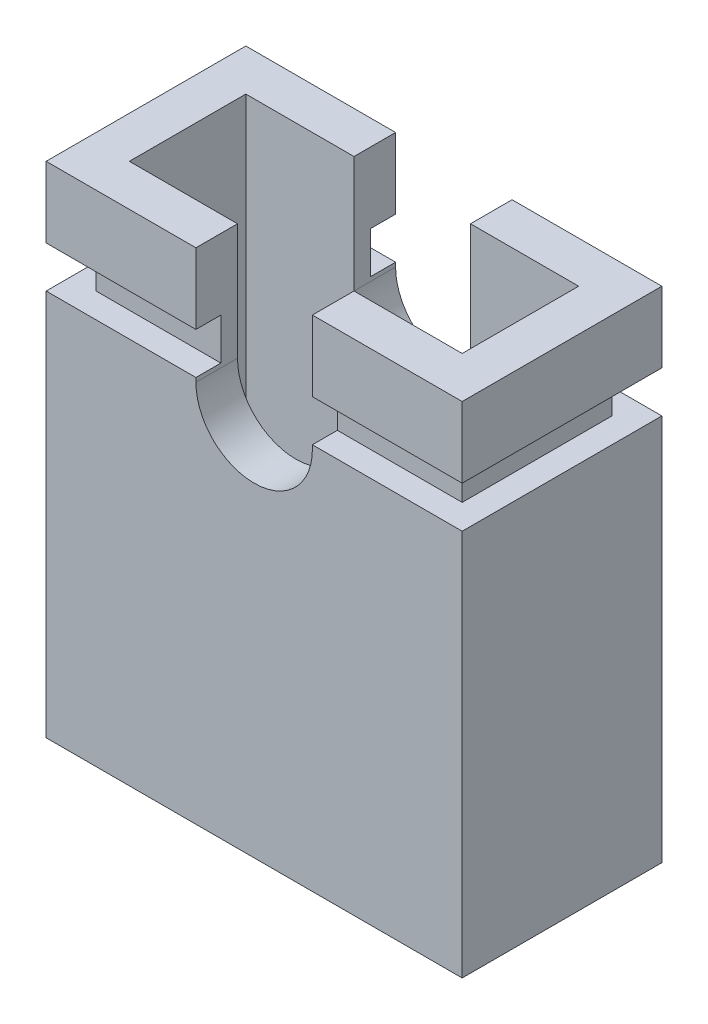
ISO-10303-21;
HEADER;
FILE_DESCRIPTION(('STEP AP214'),'2;1');
FILE_NAME('part.step','',(''),(''),'','','');
FILE_SCHEMA(('AUTOMOTIVE_DESIGN { 1 0 10303 214 1 1 1 1 }'));
ENDSEC;
DATA;
#1=APPLICATION_CONTEXT('core data for automotive mechanical design processes');
#2=APPLICATION_PROTOCOL_DEFINITION('international standard','automotive_design',2000,#1);
#3=PRODUCT_CONTEXT('',#1,'mechanical');
#4=PRODUCT('Part','Part','',(#3));
#5=PRODUCT_RELATED_PRODUCT_CATEGORY('part','',(#4));
#6=PRODUCT_DEFINITION_FORMATION('','',#4);
#7=PRODUCT_DEFINITION_CONTEXT('part definition',#1,'design');
#8=PRODUCT_DEFINITION('design','',#6,#7);
#9=PRODUCT_DEFINITION_SHAPE('','',#8);
#10=(LENGTH_UNIT() NAMED_UNIT(*) SI_UNIT(.MILLI.,.METRE.));
#11=(NAMED_UNIT(*) PLANE_ANGLE_UNIT() SI_UNIT($,.RADIAN.));
#12=(NAMED_UNIT(*) SI_UNIT($,.STERADIAN.) SOLID_ANGLE_UNIT());
#13=UNCERTAINTY_MEASURE_WITH_UNIT(LENGTH_MEASURE(1.E-05),#10,'distance_accuracy_value','');
#14=(GEOMETRIC_REPRESENTATION_CONTEXT(3) GLOBAL_UNCERTAINTY_ASSIGNED_CONTEXT((#13)) GLOBAL_UNIT_ASSIGNED_CONTEXT((#10,
#11,#12)) REPRESENTATION_CONTEXT('',''));
#15=CARTESIAN_POINT('',(0.,0.,0.));
#16=DIRECTION('',(0.,0.,1.));
#17=DIRECTION('',(1.,0.,0.));
#18=AXIS2_PLACEMENT_3D('',#15,#16,#17);
#19=CARTESIAN_POINT('',(2.6,3.,-2.448));
#20=DIRECTION('',(0.,1.,0.));
#21=DIRECTION('',(-1.,0.,0.));
#22=AXIS2_PLACEMENT_3D('',#19,#20,#21);
#23=PLANE('',#22);
#24=DIRECTION('',(0.,0.,-1.));
#25=VECTOR('',#24,1.);
#26=CARTESIAN_POINT('',(-2.,3.,-1.2));
#27=LINE('',#26,#25);
#28=CARTESIAN_POINT('',(-2.,3.,-0.5));
#29=VERTEX_POINT('',#28);
#30=CARTESIAN_POINT('',(-2.,3.,-1.9));
#31=VERTEX_POINT('',#30);
#32=EDGE_CURVE('E352',#29,#31,#27,.T.);
#33=ORIENTED_EDGE('',*,*,#32,.T.);
#34=DIRECTION('',(1.,0.,0.));
#35=VECTOR('',#34,1.);
#36=CARTESIAN_POINT('',(0.,3.,-1.9));
#37=LINE('',#36,#35);
#38=CARTESIAN_POINT('',(-0.700000000000001,3.,-1.9));
#39=VERTEX_POINT('',#38);
#40=EDGE_CURVE('E348',#31,#39,#37,.T.);
#41=ORIENTED_EDGE('',*,*,#40,.T.);
#42=DIRECTION('',(0.,0.,-1.));
#43=VECTOR('',#42,1.);
#44=CARTESIAN_POINT('',(-0.700000000000001,3.,-1.2));
#45=LINE('',#44,#43);
#46=CARTESIAN_POINT('',(-0.700000000000001,3.,-2.4));
#47=VERTEX_POINT('',#46);
#48=EDGE_CURVE('E342',#39,#47,#45,.T.);
#49=ORIENTED_EDGE('',*,*,#48,.T.);
#50=DIRECTION('',(-1.,0.,0.));
#51=VECTOR('',#50,1.);
#52=CARTESIAN_POINT('',(0.,3.,-2.4));
#53=LINE('',#52,#51);
#54=CARTESIAN_POINT('',(-2.5,3.,-2.4));
#55=VERTEX_POINT('',#54);
#56=EDGE_CURVE('E341',#47,#55,#53,.T.);
#57=ORIENTED_EDGE('',*,*,#56,.T.);
#58=DIRECTION('',(0.,0.,-1.));
#59=VECTOR('',#58,1.);
#60=CARTESIAN_POINT('',(-2.5,3.,-1.2));
#61=LINE('',#60,#59);
#62=CARTESIAN_POINT('',(-2.5,3.,0.));
#63=VERTEX_POINT('',#62);
#64=EDGE_CURVE('E338',#63,#55,#61,.T.);
#65=ORIENTED_EDGE('',*,*,#64,.F.);
#66=DIRECTION('',(-1.,0.,0.));
#67=VECTOR('',#66,1.);
#68=CARTESIAN_POINT('',(0.,3.,0.));
#69=LINE('',#68,#67);
#70=CARTESIAN_POINT('',(-0.700000000000001,3.,0.));
#71=VERTEX_POINT('',#70);
#72=EDGE_CURVE('E333',#71,#63,#69,.T.);
#73=ORIENTED_EDGE('',*,*,#72,.F.);
#74=DIRECTION('',(0.,0.,-1.));
#75=VECTOR('',#74,1.);
#76=CARTESIAN_POINT('',(-0.700000000000001,3.,-1.2));
#77=LINE('',#76,#75);
#78=CARTESIAN_POINT('',(-0.700000000000001,3.,-0.5));
#79=VERTEX_POINT('',#78);
#80=EDGE_CURVE('E345',#71,#79,#77,.T.);
#81=ORIENTED_EDGE('',*,*,#80,.T.);
#82=DIRECTION('',(-1.,0.,0.));
#83=VECTOR('',#82,1.);
#84=CARTESIAN_POINT('',(0.,3.,-0.5));
#85=LINE('',#84,#83);
#86=EDGE_CURVE('E361',#79,#29,#85,.T.);
#87=ORIENTED_EDGE('',*,*,#86,.T.);
#88=EDGE_LOOP('',(#33,#41,#49,#57,#65,#73,#81,#87));
#89=FACE_BOUND('',#88,.T.);
#90=ADVANCED_FACE('F17',(#89),#23,.T.);
#91=CARTESIAN_POINT('',(-2.6,-3.12,-2.4));
#92=DIRECTION('',(0.,0.,1.));
#93=DIRECTION('',(1.,0.,0.));
#94=AXIS2_PLACEMENT_3D('',#91,#92,#93);
#95=PLANE('',#94);
#96=DIRECTION('',(0.,-1.,0.));
#97=VECTOR('',#96,1.);
#98=CARTESIAN_POINT('',(-2.5,0.,-2.4));
#99=LINE('',#98,#97);
#100=CARTESIAN_POINT('',(-2.5,2.15,-2.4));
#101=VERTEX_POINT('',#100);
#102=EDGE_CURVE('E334',#55,#101,#99,.T.);
#103=ORIENTED_EDGE('',*,*,#102,.F.);
#104=ORIENTED_EDGE('',*,*,#56,.F.);
#105=DIRECTION('',(0.,1.,0.));
#106=VECTOR('',#105,1.);
#107=CARTESIAN_POINT('',(-0.7,0.,-2.4));
#108=LINE('',#107,#106);
#109=CARTESIAN_POINT('',(-0.7,2.15,-2.4));
#110=VERTEX_POINT('',#109);
#111=EDGE_CURVE('E351',#110,#47,#108,.T.);
#112=ORIENTED_EDGE('',*,*,#111,.F.);
#113=DIRECTION('',(-1.,0.,0.));
#114=VECTOR('',#113,1.);
#115=CARTESIAN_POINT('',(0.,2.15,-2.4));
#116=LINE('',#115,#114);
#117=EDGE_CURVE('E288',#110,#101,#116,.T.);
#118=ORIENTED_EDGE('',*,*,#117,.T.);
#119=EDGE_LOOP('',(#103,#104,#112,#118));
#120=FACE_BOUND('',#119,.T.);
#121=ADVANCED_FACE('F653',(#120),#95,.F.);
#122=CARTESIAN_POINT('',(-2.5,3.12,-2.448));
#123=DIRECTION('',(-1.,0.,0.));
#124=DIRECTION('',(0.,-1.,0.));
#125=AXIS2_PLACEMENT_3D('',#122,#123,#124);
#126=PLANE('',#125);
#127=ORIENTED_EDGE('',*,*,#64,.T.);
#128=ORIENTED_EDGE('',*,*,#102,.T.);
#129=DIRECTION('',(0.,0.,1.));
#130=VECTOR('',#129,1.);
#131=CARTESIAN_POINT('',(-2.5,2.15,-1.2));
#132=LINE('',#131,#130);
#133=CARTESIAN_POINT('',(-2.5,2.15,0.));
#134=VERTEX_POINT('',#133);
#135=EDGE_CURVE('E286',#101,#134,#132,.T.);
#136=ORIENTED_EDGE('',*,*,#135,.T.);
#137=DIRECTION('',(0.,-1.,0.));
#138=VECTOR('',#137,1.);
#139=CARTESIAN_POINT('',(-2.5,0.,0.));
#140=LINE('',#139,#138);
#141=EDGE_CURVE('E290',#63,#134,#140,.T.);
#142=ORIENTED_EDGE('',*,*,#141,.F.);
#143=EDGE_LOOP('',(#127,#128,#136,#142));
#144=FACE_BOUND('',#143,.T.);
#145=ADVANCED_FACE('F649',(#144),#126,.T.);
#146=CARTESIAN_POINT('',(-2.6,-3.12,0.));
#147=DIRECTION('',(0.,0.,1.));
#148=DIRECTION('',(1.,0.,0.));
#149=AXIS2_PLACEMENT_3D('',#146,#147,#148);
#150=PLANE('',#149);
#151=ORIENTED_EDGE('',*,*,#141,.T.);
#152=DIRECTION('',(1.,0.,0.));
#153=VECTOR('',#152,1.);
#154=CARTESIAN_POINT('',(0.,2.15,0.));
#155=LINE('',#154,#153);
#156=CARTESIAN_POINT('',(-0.7,2.15,0.));
#157=VERTEX_POINT('',#156);
#158=EDGE_CURVE('E283',#134,#157,#155,.T.);
#159=ORIENTED_EDGE('',*,*,#158,.T.);
#160=DIRECTION('',(0.,1.,0.));
#161=VECTOR('',#160,1.);
#162=CARTESIAN_POINT('',(-0.7,0.,0.));
#163=LINE('',#162,#161);
#164=EDGE_CURVE('E337',#157,#71,#163,.T.);
#165=ORIENTED_EDGE('',*,*,#164,.T.);
#166=ORIENTED_EDGE('',*,*,#72,.T.);
#167=EDGE_LOOP('',(#151,#159,#165,#166));
#168=FACE_BOUND('',#167,.T.);
#169=ADVANCED_FACE('F646',(#168),#150,.T.);
#170=CARTESIAN_POINT('',(2.6,2.15,-2.448));
#171=DIRECTION('',(0.,1.,0.));
#172=DIRECTION('',(-1.,0.,0.));
#173=AXIS2_PLACEMENT_3D('',#170,#171,#172);
#174=PLANE('',#173);
#175=DIRECTION('',(0.,0.,-1.));
#176=VECTOR('',#175,1.);
#177=CARTESIAN_POINT('',(-2.2,2.15,-1.2));
#178=LINE('',#177,#176);
#179=CARTESIAN_POINT('',(-2.2,2.15,-0.3));
#180=VERTEX_POINT('',#179);
#181=CARTESIAN_POINT('',(-2.2,2.15,-2.1));
#182=VERTEX_POINT('',#181);
#183=EDGE_CURVE('E450',#180,#182,#178,.T.);
#184=ORIENTED_EDGE('',*,*,#183,.F.);
#185=DIRECTION('',(-1.,0.,0.));
#186=VECTOR('',#185,1.);
#187=CARTESIAN_POINT('',(0.,2.15,-0.3));
#188=LINE('',#187,#186);
#189=CARTESIAN_POINT('',(-0.700000000000001,2.15,-0.3));
#190=VERTEX_POINT('',#189);
#191=EDGE_CURVE('E270',#190,#180,#188,.T.);
#192=ORIENTED_EDGE('',*,*,#191,.F.);
#193=DIRECTION('',(0.,0.,1.));
#194=VECTOR('',#193,1.);
#195=CARTESIAN_POINT('',(-0.7,2.15,-1.2));
#196=LINE('',#195,#194);
#197=EDGE_CURVE('E262',#190,#157,#196,.T.);
#198=ORIENTED_EDGE('',*,*,#197,.T.);
#199=ORIENTED_EDGE('',*,*,#158,.F.);
#200=ORIENTED_EDGE('',*,*,#135,.F.);
#201=ORIENTED_EDGE('',*,*,#117,.F.);
#202=DIRECTION('',(0.,0.,1.));
#203=VECTOR('',#202,1.);
#204=CARTESIAN_POINT('',(-0.7,2.15,-1.2));
#205=LINE('',#204,#203);
#206=CARTESIAN_POINT('',(-0.7,2.15,-2.1));
#207=VERTEX_POINT('',#206);
#208=EDGE_CURVE('E265',#110,#207,#205,.T.);
#209=ORIENTED_EDGE('',*,*,#208,.T.);
#210=DIRECTION('',(1.,0.,0.));
#211=VECTOR('',#210,1.);
#212=CARTESIAN_POINT('',(0.,2.15,-2.1));
#213=LINE('',#212,#211);
#214=EDGE_CURVE('E308',#182,#207,#213,.T.);
#215=ORIENTED_EDGE('',*,*,#214,.F.);
#216=EDGE_LOOP('',(#184,#192,#198,#199,#200,#201,#209,#215));
#217=FACE_BOUND('',#216,.T.);
#218=ADVANCED_FACE('F530',(#217),#174,.F.);
#219=CARTESIAN_POINT('',(-0.7,1.572,0.048));
#220=DIRECTION('',(-1.,0.,0.));
#221=DIRECTION('',(0.,1.,0.));
#222=AXIS2_PLACEMENT_3D('',#219,#220,#221);
#223=PLANE('',#222);
#224=DIRECTION('',(0.,1.,0.));
#225=VECTOR('',#224,1.);
#226=CARTESIAN_POINT('',(-0.7,1.9,-0.3));
#227=LINE('',#226,#225);
#228=CARTESIAN_POINT('',(-0.7,1.65,-0.3));
#229=VERTEX_POINT('',#228);
#230=EDGE_CURVE('E444',#229,#190,#227,.T.);
#231=ORIENTED_EDGE('',*,*,#230,.F.);
#232=DIRECTION('',(0.,0.,-1.));
#233=VECTOR('',#232,1.);
#234=CARTESIAN_POINT('',(-0.7,1.65,-1.2));
#235=LINE('',#234,#233);
#236=CARTESIAN_POINT('',(-0.7,1.65,0.));
#237=VERTEX_POINT('',#236);
#238=EDGE_CURVE('E266',#237,#229,#235,.T.);
#239=ORIENTED_EDGE('',*,*,#238,.F.);
#240=DIRECTION('',(0.,1.,0.));
#241=VECTOR('',#240,1.);
#242=CARTESIAN_POINT('',(-0.7,2.3,0.));
#243=LINE('',#242,#241);
#244=CARTESIAN_POINT('',(-0.7,1.6,0.));
#245=VERTEX_POINT('',#244);
#246=EDGE_CURVE('E269',#245,#237,#243,.T.);
#247=ORIENTED_EDGE('',*,*,#246,.F.);
#248=DIRECTION('',(0.,0.,1.));
#249=VECTOR('',#248,1.);
#250=CARTESIAN_POINT('',(-0.7,1.6,-1.2));
#251=LINE('',#250,#249);
#252=CARTESIAN_POINT('',(-0.7,1.6,-0.500000000000022));
#253=VERTEX_POINT('',#252);
#254=EDGE_CURVE('E267',#253,#245,#251,.T.);
#255=ORIENTED_EDGE('',*,*,#254,.F.);
#256=DIRECTION('',(0.,1.,0.));
#257=VECTOR('',#256,1.);
#258=CARTESIAN_POINT('',(-0.7,0.,-0.5));
#259=LINE('',#258,#257);
#260=EDGE_CURVE('E367',#253,#79,#259,.T.);
#261=ORIENTED_EDGE('',*,*,#260,.T.);
#262=ORIENTED_EDGE('',*,*,#80,.F.);
#263=ORIENTED_EDGE('',*,*,#164,.F.);
#264=ORIENTED_EDGE('',*,*,#197,.F.);
#265=EDGE_LOOP('',(#231,#239,#247,#255,#261,#262,#263,#264));
#266=FACE_BOUND('',#265,.T.);
#267=ADVANCED_FACE('F527',(#266),#223,.F.);
#268=CARTESIAN_POINT('',(-0.7,1.572,0.048));
#269=DIRECTION('',(-1.,0.,0.));
#270=DIRECTION('',(0.,1.,0.));
#271=AXIS2_PLACEMENT_3D('',#268,#269,#270);
#272=PLANE('',#271);
#273=DIRECTION('',(0.,1.,0.));
#274=VECTOR('',#273,1.);
#275=CARTESIAN_POINT('',(-0.7,0.,-1.9));
#276=LINE('',#275,#274);
#277=CARTESIAN_POINT('',(-0.7,1.6,-1.89999999999998));
#278=VERTEX_POINT('',#277);
#279=EDGE_CURVE('E239',#278,#39,#276,.T.);
#280=ORIENTED_EDGE('',*,*,#279,.F.);
#281=DIRECTION('',(0.,0.,1.));
#282=VECTOR('',#281,1.);
#283=CARTESIAN_POINT('',(-0.7,1.6,-1.2));
#284=LINE('',#283,#282);
#285=CARTESIAN_POINT('',(-0.7,1.6,-2.39999999999996));
#286=VERTEX_POINT('',#285);
#287=EDGE_CURVE('E224',#286,#278,#284,.T.);
#288=ORIENTED_EDGE('',*,*,#287,.F.);
#289=DIRECTION('',(0.,-1.,0.));
#290=VECTOR('',#289,1.);
#291=CARTESIAN_POINT('',(-0.7,2.3,-2.4));
#292=LINE('',#291,#290);
#293=CARTESIAN_POINT('',(-0.7,1.65,-2.4));
#294=VERTEX_POINT('',#293);
#295=EDGE_CURVE('E291',#294,#286,#292,.T.);
#296=ORIENTED_EDGE('',*,*,#295,.F.);
#297=DIRECTION('',(0.,0.,-1.));
#298=VECTOR('',#297,1.);
#299=CARTESIAN_POINT('',(-0.7,1.65,-1.2));
#300=LINE('',#299,#298);
#301=CARTESIAN_POINT('',(-0.7,1.65,-2.1));
#302=VERTEX_POINT('',#301);
#303=EDGE_CURVE('E293',#302,#294,#300,.T.);
#304=ORIENTED_EDGE('',*,*,#303,.F.);
#305=DIRECTION('',(0.,-1.,0.));
#306=VECTOR('',#305,1.);
#307=CARTESIAN_POINT('',(-0.7,1.9,-2.1));
#308=LINE('',#307,#306);
#309=EDGE_CURVE('E305',#207,#302,#308,.T.);
#310=ORIENTED_EDGE('',*,*,#309,.F.);
#311=ORIENTED_EDGE('',*,*,#208,.F.);
#312=ORIENTED_EDGE('',*,*,#111,.T.);
#313=ORIENTED_EDGE('',*,*,#48,.F.);
#314=EDGE_LOOP('',(#280,#288,#296,#304,#310,#311,#312,#313));
#315=FACE_BOUND('',#314,.T.);
#316=ADVANCED_FACE('F545',(#315),#272,.F.);
#317=CARTESIAN_POINT('',(-2.,3.12,-1.928));
#318=DIRECTION('',(-1.,0.,0.));
#319=DIRECTION('',(0.,-1.,0.));
#320=AXIS2_PLACEMENT_3D('',#317,#318,#319);
#321=PLANE('',#320);
#322=DIRECTION('',(0.,0.,1.));
#323=VECTOR('',#322,1.);
#324=CARTESIAN_POINT('',(-2.,-3.,-1.2));
#325=LINE('',#324,#323);
#326=CARTESIAN_POINT('',(-2.,-3.,-1.9));
#327=VERTEX_POINT('',#326);
#328=CARTESIAN_POINT('',(-2.,-3.,-0.5));
#329=VERTEX_POINT('',#328);
#330=EDGE_CURVE('E458',#327,#329,#325,.T.);
#331=ORIENTED_EDGE('',*,*,#330,.F.);
#332=DIRECTION('',(0.,-1.,0.));
#333=VECTOR('',#332,1.);
#334=CARTESIAN_POINT('',(-2.,0.,-1.9));
#335=LINE('',#334,#333);
#336=EDGE_CURVE('E254',#31,#327,#335,.T.);
#337=ORIENTED_EDGE('',*,*,#336,.F.);
#338=ORIENTED_EDGE('',*,*,#32,.F.);
#339=DIRECTION('',(0.,-1.,0.));
#340=VECTOR('',#339,1.);
#341=CARTESIAN_POINT('',(-2.,0.,-0.5));
#342=LINE('',#341,#340);
#343=EDGE_CURVE('E364',#29,#329,#342,.T.);
#344=ORIENTED_EDGE('',*,*,#343,.T.);
#345=EDGE_LOOP('',(#331,#337,#338,#344));
#346=FACE_BOUND('',#345,.T.);
#347=ADVANCED_FACE('F551',(#346),#321,.F.);
#348=CARTESIAN_POINT('',(2.,-3.12,-1.928));
#349=DIRECTION('',(1.,0.,0.));
#350=DIRECTION('',(0.,1.,0.));
#351=AXIS2_PLACEMENT_3D('',#348,#349,#350);
#352=PLANE('',#351);
#353=DIRECTION('',(0.,0.,-1.));
#354=VECTOR('',#353,1.);
#355=CARTESIAN_POINT('',(2.,-3.,-1.2));
#356=LINE('',#355,#354);
#357=CARTESIAN_POINT('',(2.,-3.,-0.5));
#358=VERTEX_POINT('',#357);
#359=CARTESIAN_POINT('',(2.,-3.,-1.9));
#360=VERTEX_POINT('',#359);
#361=EDGE_CURVE('E309',#358,#360,#356,.T.);
#362=ORIENTED_EDGE('',*,*,#361,.F.);
#363=DIRECTION('',(0.,1.,0.));
#364=VECTOR('',#363,1.);
#365=CARTESIAN_POINT('',(2.,0.,-0.5));
#366=LINE('',#365,#364);
#367=CARTESIAN_POINT('',(2.,3.,-0.5));
#368=VERTEX_POINT('',#367);
#369=EDGE_CURVE('E272',#358,#368,#366,.T.);
#370=ORIENTED_EDGE('',*,*,#369,.T.);
#371=DIRECTION('',(0.,0.,1.));
#372=VECTOR('',#371,1.);
#373=CARTESIAN_POINT('',(2.,3.,-1.2));
#374=LINE('',#373,#372);
#375=CARTESIAN_POINT('',(2.,3.,-1.9));
#376=VERTEX_POINT('',#375);
#377=EDGE_CURVE('E456',#376,#368,#374,.T.);
#378=ORIENTED_EDGE('',*,*,#377,.F.);
#379=DIRECTION('',(0.,1.,0.));
#380=VECTOR('',#379,1.);
#381=CARTESIAN_POINT('',(2.,0.,-1.9));
#382=LINE('',#381,#380);
#383=EDGE_CURVE('E252',#360,#376,#382,.T.);
#384=ORIENTED_EDGE('',*,*,#383,.F.);
#385=EDGE_LOOP('',(#362,#370,#378,#384));
#386=FACE_BOUND('',#385,.T.);
#387=ADVANCED_FACE('F564',(#386),#352,.F.);
#388=CARTESIAN_POINT('',(2.288,1.639690470428,-2.1));
#389=DIRECTION('',(0.,0.,-1.));
#390=DIRECTION('',(-1.,0.,0.));
#391=AXIS2_PLACEMENT_3D('',#388,#389,#390);
#392=PLANE('',#391);
#393=DIRECTION('',(0.,-1.,0.));
#394=VECTOR('',#393,1.);
#395=CARTESIAN_POINT('',(-2.2,1.9,-2.1));
#396=LINE('',#395,#394);
#397=CARTESIAN_POINT('',(-2.2,1.65,-2.1));
#398=VERTEX_POINT('',#397);
#399=EDGE_CURVE('E447',#182,#398,#396,.T.);
#400=ORIENTED_EDGE('',*,*,#399,.F.);
#401=ORIENTED_EDGE('',*,*,#214,.T.);
#402=ORIENTED_EDGE('',*,*,#309,.T.);
#403=DIRECTION('',(-1.,0.,0.));
#404=VECTOR('',#403,1.);
#405=CARTESIAN_POINT('',(0.,1.65,-2.1));
#406=LINE('',#405,#404);
#407=EDGE_CURVE('E312',#302,#398,#406,.T.);
#408=ORIENTED_EDGE('',*,*,#407,.T.);
#409=EDGE_LOOP('',(#400,#401,#402,#408));
#410=FACE_BOUND('',#409,.T.);
#411=ADVANCED_FACE('F536',(#410),#392,.T.);
#412=CARTESIAN_POINT('',(-2.2,1.639690470428,-2.136));
#413=DIRECTION('',(-1.,0.,0.));
#414=DIRECTION('',(0.,0.,1.));
#415=AXIS2_PLACEMENT_3D('',#412,#413,#414);
#416=PLANE('',#415);
#417=ORIENTED_EDGE('',*,*,#399,.T.);
#418=DIRECTION('',(0.,0.,1.));
#419=VECTOR('',#418,1.);
#420=CARTESIAN_POINT('',(-2.2,1.65,-1.2));
#421=LINE('',#420,#419);
#422=CARTESIAN_POINT('',(-2.2,1.65,-0.3));
#423=VERTEX_POINT('',#422);
#424=EDGE_CURVE('E314',#398,#423,#421,.T.);
#425=ORIENTED_EDGE('',*,*,#424,.T.);
#426=DIRECTION('',(0.,-1.,0.));
#427=VECTOR('',#426,1.);
#428=CARTESIAN_POINT('',(-2.2,1.9,-0.3));
#429=LINE('',#428,#427);
#430=EDGE_CURVE('E439',#180,#423,#429,.T.);
#431=ORIENTED_EDGE('',*,*,#430,.F.);
#432=ORIENTED_EDGE('',*,*,#183,.T.);
#433=EDGE_LOOP('',(#417,#425,#431,#432));
#434=FACE_BOUND('',#433,.T.);
#435=ADVANCED_FACE('F514',(#434),#416,.T.);
#436=CARTESIAN_POINT('',(-2.288,1.639690470428,-0.3));
#437=DIRECTION('',(0.,0.,1.));
#438=DIRECTION('',(1.,0.,0.));
#439=AXIS2_PLACEMENT_3D('',#436,#437,#438);
#440=PLANE('',#439);
#441=ORIENTED_EDGE('',*,*,#430,.T.);
#442=DIRECTION('',(1.,0.,0.));
#443=VECTOR('',#442,1.);
#444=CARTESIAN_POINT('',(0.,1.65,-0.3));
#445=LINE('',#444,#443);
#446=EDGE_CURVE('E507',#423,#229,#445,.T.);
#447=ORIENTED_EDGE('',*,*,#446,.T.);
#448=ORIENTED_EDGE('',*,*,#230,.T.);
#449=ORIENTED_EDGE('',*,*,#191,.T.);
#450=EDGE_LOOP('',(#441,#447,#448,#449));
#451=FACE_BOUND('',#450,.T.);
#452=ADVANCED_FACE('F518',(#451),#440,.T.);
#453=CARTESIAN_POINT('',(-2.08,-3.12,-0.5));
#454=DIRECTION('',(0.,0.,1.));
#455=DIRECTION('',(1.,0.,0.));
#456=AXIS2_PLACEMENT_3D('',#453,#454,#455);
#457=PLANE('',#456);
#458=ORIENTED_EDGE('',*,*,#369,.F.);
#459=DIRECTION('',(1.,0.,0.));
#460=VECTOR('',#459,1.);
#461=CARTESIAN_POINT('',(0.,-3.,-0.5));
#462=LINE('',#461,#460);
#463=EDGE_CURVE('E499',#329,#358,#462,.T.);
#464=ORIENTED_EDGE('',*,*,#463,.F.);
#465=ORIENTED_EDGE('',*,*,#343,.F.);
#466=ORIENTED_EDGE('',*,*,#86,.F.);
#467=ORIENTED_EDGE('',*,*,#260,.F.);
#468=CARTESIAN_POINT('',(0.,1.6,-0.500000000000045));
#469=DIRECTION('',(0.,0.,-1.));
#470=DIRECTION('',(-1.,0.,0.));
#471=AXIS2_PLACEMENT_3D('',#468,#469,#470);
#472=CIRCLE('',#471,0.7);
#473=CARTESIAN_POINT('',(0.7,1.59999999999993,-0.500000000000022));
#474=VERTEX_POINT('',#473);
#475=EDGE_CURVE('E315',#474,#253,#472,.T.);
#476=ORIENTED_EDGE('',*,*,#475,.F.);
#477=DIRECTION('',(0.,-1.,0.));
#478=VECTOR('',#477,1.);
#479=CARTESIAN_POINT('',(0.7,0.,-0.5));
#480=LINE('',#479,#478);
#481=CARTESIAN_POINT('',(0.7,3.,-0.5));
#482=VERTEX_POINT('',#481);
#483=EDGE_CURVE('E435',#482,#474,#480,.T.);
#484=ORIENTED_EDGE('',*,*,#483,.F.);
#485=DIRECTION('',(-1.,0.,0.));
#486=VECTOR('',#485,1.);
#487=CARTESIAN_POINT('',(0.,3.,-0.5));
#488=LINE('',#487,#486);
#489=EDGE_CURVE('E240',#368,#482,#488,.T.);
#490=ORIENTED_EDGE('',*,*,#489,.F.);
#491=EDGE_LOOP('',(#458,#464,#465,#466,#467,#476,#484,#490));
#492=FACE_BOUND('',#491,.T.);
#493=ADVANCED_FACE('F555',(#492),#457,.F.);
#494=CARTESIAN_POINT('',(-2.08,-3.12,-1.9));
#495=DIRECTION('',(0.,0.,1.));
#496=DIRECTION('',(1.,0.,0.));
#497=AXIS2_PLACEMENT_3D('',#494,#495,#496);
#498=PLANE('',#497);
#499=ORIENTED_EDGE('',*,*,#383,.T.);
#500=DIRECTION('',(-1.,0.,0.));
#501=VECTOR('',#500,1.);
#502=CARTESIAN_POINT('',(0.,3.,-1.9));
#503=LINE('',#502,#501);
#504=CARTESIAN_POINT('',(0.7,3.,-1.9));
#505=VERTEX_POINT('',#504);
#506=EDGE_CURVE('E236',#376,#505,#503,.T.);
#507=ORIENTED_EDGE('',*,*,#506,.T.);
#508=DIRECTION('',(0.,-1.,0.));
#509=VECTOR('',#508,1.);
#510=CARTESIAN_POINT('',(0.7,0.,-1.9));
#511=LINE('',#510,#509);
#512=CARTESIAN_POINT('',(0.7,1.59999999999993,-1.89999999999998));
#513=VERTEX_POINT('',#512);
#514=EDGE_CURVE('E230',#505,#513,#511,.T.);
#515=ORIENTED_EDGE('',*,*,#514,.T.);
#516=CARTESIAN_POINT('',(0.,1.6,-1.89999999999995));
#517=DIRECTION('',(0.,0.,-1.));
#518=DIRECTION('',(0.,1.,0.));
#519=AXIS2_PLACEMENT_3D('',#516,#517,#518);
#520=CIRCLE('',#519,0.7);
#521=EDGE_CURVE('E21',#278,#513,#520,.F.);
#522=ORIENTED_EDGE('',*,*,#521,.F.);
#523=ORIENTED_EDGE('',*,*,#279,.T.);
#524=ORIENTED_EDGE('',*,*,#40,.F.);
#525=ORIENTED_EDGE('',*,*,#336,.T.);
#526=DIRECTION('',(-1.,0.,0.));
#527=VECTOR('',#526,1.);
#528=CARTESIAN_POINT('',(0.,-3.,-1.9));
#529=LINE('',#528,#527);
#530=EDGE_CURVE('E494',#360,#327,#529,.T.);
#531=ORIENTED_EDGE('',*,*,#530,.F.);
#532=EDGE_LOOP('',(#499,#507,#515,#522,#523,#524,#525,#531));
#533=FACE_BOUND('',#532,.T.);
#534=ADVANCED_FACE('F233',(#533),#498,.T.);
#535=CARTESIAN_POINT('',(0.,1.6,-1.89999999999995));
#536=DIRECTION('',(0.,0.,-1.));
#537=DIRECTION('',(0.,1.,0.));
#538=AXIS2_PLACEMENT_3D('',#535,#536,#537);
#539=CYLINDRICAL_SURFACE('',#538,0.7);
#540=ORIENTED_EDGE('',*,*,#521,.T.);
#541=DIRECTION('',(0.,0.,-1.));
#542=VECTOR('',#541,1.);
#543=CARTESIAN_POINT('',(0.7,1.59999999999986,-1.2));
#544=LINE('',#543,#542);
#545=CARTESIAN_POINT('',(0.7,1.59999999999993,-2.39999999999996));
#546=VERTEX_POINT('',#545);
#547=EDGE_CURVE('E243',#513,#546,#544,.T.);
#548=ORIENTED_EDGE('',*,*,#547,.T.);
#549=CARTESIAN_POINT('',(0.,1.6,-2.39999999999992));
#550=DIRECTION('',(0.,0.,-1.));
#551=DIRECTION('',(0.,1.,0.));
#552=AXIS2_PLACEMENT_3D('',#549,#550,#551);
#553=CIRCLE('',#552,0.7);
#554=EDGE_CURVE('E299',#546,#286,#553,.T.);
#555=ORIENTED_EDGE('',*,*,#554,.T.);
#556=ORIENTED_EDGE('',*,*,#287,.T.);
#557=EDGE_LOOP('',(#540,#548,#555,#556));
#558=FACE_BOUND('',#557,.T.);
#559=ADVANCED_FACE('F251',(#558),#539,.F.);
#560=CARTESIAN_POINT('',(0.,1.6,0.));
#561=DIRECTION('',(0.,0.,-1.));
#562=DIRECTION('',(-1.,0.,0.));
#563=AXIS2_PLACEMENT_3D('',#560,#561,#562);
#564=CYLINDRICAL_SURFACE('',#563,0.7);
#565=ORIENTED_EDGE('',*,*,#475,.T.);
#566=ORIENTED_EDGE('',*,*,#254,.T.);
#567=CARTESIAN_POINT('',(0.,1.6,0.));
#568=DIRECTION('',(0.,0.,1.));
#569=DIRECTION('',(1.,0.,0.));
#570=AXIS2_PLACEMENT_3D('',#567,#568,#569);
#571=CIRCLE('',#570,0.7);
#572=CARTESIAN_POINT('',(0.7,1.59999999999993,0.));
#573=VERTEX_POINT('',#572);
#574=EDGE_CURVE('E325',#573,#245,#571,.F.);
#575=ORIENTED_EDGE('',*,*,#574,.F.);
#576=DIRECTION('',(0.,0.,-1.));
#577=VECTOR('',#576,1.);
#578=CARTESIAN_POINT('',(0.7,1.59999999999986,-1.2));
#579=LINE('',#578,#577);
#580=EDGE_CURVE('E249',#573,#474,#579,.T.);
#581=ORIENTED_EDGE('',*,*,#580,.T.);
#582=EDGE_LOOP('',(#565,#566,#575,#581));
#583=FACE_BOUND('',#582,.T.);
#584=ADVANCED_FACE('F625',(#583),#564,.F.);
#585=CARTESIAN_POINT('',(-2.6,1.65,-2.448));
#586=DIRECTION('',(0.,-1.,0.));
#587=DIRECTION('',(1.,0.,0.));
#588=AXIS2_PLACEMENT_3D('',#585,#586,#587);
#589=PLANE('',#588);
#590=DIRECTION('',(0.,0.,-1.));
#591=VECTOR('',#590,1.);
#592=CARTESIAN_POINT('',(-2.5,1.65,-1.2));
#593=LINE('',#592,#591);
#594=CARTESIAN_POINT('',(-2.5,1.65,0.));
#595=VERTEX_POINT('',#594);
#596=CARTESIAN_POINT('',(-2.5,1.65,-2.4));
#597=VERTEX_POINT('',#596);
#598=EDGE_CURVE('E505',#595,#597,#593,.T.);
#599=ORIENTED_EDGE('',*,*,#598,.F.);
#600=DIRECTION('',(-1.,0.,0.));
#601=VECTOR('',#600,1.);
#602=CARTESIAN_POINT('',(0.,1.65,0.));
#603=LINE('',#602,#601);
#604=EDGE_CURVE('E321',#237,#595,#603,.T.);
#605=ORIENTED_EDGE('',*,*,#604,.F.);
#606=ORIENTED_EDGE('',*,*,#238,.T.);
#607=ORIENTED_EDGE('',*,*,#446,.F.);
#608=ORIENTED_EDGE('',*,*,#424,.F.);
#609=ORIENTED_EDGE('',*,*,#407,.F.);
#610=ORIENTED_EDGE('',*,*,#303,.T.);
#611=DIRECTION('',(-1.,0.,0.));
#612=VECTOR('',#611,1.);
#613=CARTESIAN_POINT('',(0.,1.65,-2.4));
#614=LINE('',#613,#612);
#615=EDGE_CURVE('E296',#294,#597,#614,.T.);
#616=ORIENTED_EDGE('',*,*,#615,.T.);
#617=EDGE_LOOP('',(#599,#605,#606,#607,#608,#609,#610,#616));
#618=FACE_BOUND('',#617,.T.);
#619=ADVANCED_FACE('F520',(#618),#589,.F.);
#620=CARTESIAN_POINT('',(-2.5,3.12,-2.448));
#621=DIRECTION('',(-1.,0.,0.));
#622=DIRECTION('',(0.,-1.,0.));
#623=AXIS2_PLACEMENT_3D('',#620,#621,#622);
#624=PLANE('',#623);
#625=DIRECTION('',(0.,0.,-1.));
#626=VECTOR('',#625,1.);
#627=CARTESIAN_POINT('',(-2.5,-3.,-1.2));
#628=LINE('',#627,#626);
#629=CARTESIAN_POINT('',(-2.5,-3.,0.));
#630=VERTEX_POINT('',#629);
#631=CARTESIAN_POINT('',(-2.5,-3.,-2.4));
#632=VERTEX_POINT('',#631);
#633=EDGE_CURVE('E502',#630,#632,#628,.T.);
#634=ORIENTED_EDGE('',*,*,#633,.F.);
#635=DIRECTION('',(0.,-1.,0.));
#636=VECTOR('',#635,1.);
#637=CARTESIAN_POINT('',(-2.5,0.,0.));
#638=LINE('',#637,#636);
#639=EDGE_CURVE('E324',#595,#630,#638,.T.);
#640=ORIENTED_EDGE('',*,*,#639,.F.);
#641=ORIENTED_EDGE('',*,*,#598,.T.);
#642=DIRECTION('',(0.,-1.,0.));
#643=VECTOR('',#642,1.);
#644=CARTESIAN_POINT('',(-2.5,0.,-2.4));
#645=LINE('',#644,#643);
#646=EDGE_CURVE('E298',#597,#632,#645,.T.);
#647=ORIENTED_EDGE('',*,*,#646,.T.);
#648=EDGE_LOOP('',(#634,#640,#641,#647));
#649=FACE_BOUND('',#648,.T.);
#650=ADVANCED_FACE('F619',(#649),#624,.T.);
#651=CARTESIAN_POINT('',(-2.6,-3.,-2.448));
#652=DIRECTION('',(0.,-1.,0.));
#653=DIRECTION('',(1.,0.,0.));
#654=AXIS2_PLACEMENT_3D('',#651,#652,#653);
#655=PLANE('',#654);
#656=ORIENTED_EDGE('',*,*,#530,.T.);
#657=ORIENTED_EDGE('',*,*,#330,.T.);
#658=ORIENTED_EDGE('',*,*,#463,.T.);
#659=ORIENTED_EDGE('',*,*,#361,.T.);
#660=EDGE_LOOP('',(#656,#657,#658,#659));
#661=FACE_BOUND('',#660,.T.);
#662=DIRECTION('',(1.,0.,0.));
#663=VECTOR('',#662,1.);
#664=CARTESIAN_POINT('',(0.,-3.,-2.4));
#665=LINE('',#664,#663);
#666=CARTESIAN_POINT('',(2.5,-3.,-2.4));
#667=VERTEX_POINT('',#666);
#668=EDGE_CURVE('E490',#632,#667,#665,.T.);
#669=ORIENTED_EDGE('',*,*,#668,.T.);
#670=DIRECTION('',(0.,0.,-1.));
#671=VECTOR('',#670,1.);
#672=CARTESIAN_POINT('',(2.5,-3.,-1.2));
#673=LINE('',#672,#671);
#674=CARTESIAN_POINT('',(2.5,-3.,0.));
#675=VERTEX_POINT('',#674);
#676=EDGE_CURVE('E487',#675,#667,#673,.T.);
#677=ORIENTED_EDGE('',*,*,#676,.F.);
#678=DIRECTION('',(1.,0.,0.));
#679=VECTOR('',#678,1.);
#680=CARTESIAN_POINT('',(0.,-3.,0.));
#681=LINE('',#680,#679);
#682=EDGE_CURVE('E475',#630,#675,#681,.T.);
#683=ORIENTED_EDGE('',*,*,#682,.F.);
#684=ORIENTED_EDGE('',*,*,#633,.T.);
#685=EDGE_LOOP('',(#669,#677,#683,#684));
#686=FACE_BOUND('',#685,.T.);
#687=ADVANCED_FACE('F559',(#661,#686),#655,.T.);
#688=CARTESIAN_POINT('',(-2.6,-3.12,-2.4));
#689=DIRECTION('',(0.,0.,1.));
#690=DIRECTION('',(1.,0.,0.));
#691=AXIS2_PLACEMENT_3D('',#688,#689,#690);
#692=PLANE('',#691);
#693=DIRECTION('',(0.,1.,0.));
#694=VECTOR('',#693,1.);
#695=CARTESIAN_POINT('',(2.5,0.,-2.4));
#696=LINE('',#695,#694);
#697=CARTESIAN_POINT('',(2.5,1.65,-2.4));
#698=VERTEX_POINT('',#697);
#699=EDGE_CURVE('E482',#667,#698,#696,.T.);
#700=ORIENTED_EDGE('',*,*,#699,.F.);
#701=ORIENTED_EDGE('',*,*,#668,.F.);
#702=ORIENTED_EDGE('',*,*,#646,.F.);
#703=ORIENTED_EDGE('',*,*,#615,.F.);
#704=ORIENTED_EDGE('',*,*,#295,.T.);
#705=ORIENTED_EDGE('',*,*,#554,.F.);
#706=DIRECTION('',(0.,-1.,0.));
#707=VECTOR('',#706,1.);
#708=CARTESIAN_POINT('',(0.700000000000001,0.,-2.4));
#709=LINE('',#708,#707);
#710=CARTESIAN_POINT('',(0.700000000000001,1.65,-2.4));
#711=VERTEX_POINT('',#710);
#712=EDGE_CURVE('E247',#711,#546,#709,.T.);
#713=ORIENTED_EDGE('',*,*,#712,.F.);
#714=DIRECTION('',(1.,0.,0.));
#715=VECTOR('',#714,1.);
#716=CARTESIAN_POINT('',(0.,1.65,-2.4));
#717=LINE('',#716,#715);
#718=EDGE_CURVE('E415',#711,#698,#717,.T.);
#719=ORIENTED_EDGE('',*,*,#718,.T.);
#720=EDGE_LOOP('',(#700,#701,#702,#703,#704,#705,#713,#719));
#721=FACE_BOUND('',#720,.T.);
#722=ADVANCED_FACE('F543',(#721),#692,.F.);
#723=CARTESIAN_POINT('',(2.5,-3.12,-2.448));
#724=DIRECTION('',(1.,0.,0.));
#725=DIRECTION('',(0.,1.,0.));
#726=AXIS2_PLACEMENT_3D('',#723,#724,#725);
#727=PLANE('',#726);
#728=ORIENTED_EDGE('',*,*,#676,.T.);
#729=ORIENTED_EDGE('',*,*,#699,.T.);
#730=DIRECTION('',(0.,0.,1.));
#731=VECTOR('',#730,1.);
#732=CARTESIAN_POINT('',(2.5,1.65,-1.2));
#733=LINE('',#732,#731);
#734=CARTESIAN_POINT('',(2.5,1.65,0.));
#735=VERTEX_POINT('',#734);
#736=EDGE_CURVE('E408',#698,#735,#733,.T.);
#737=ORIENTED_EDGE('',*,*,#736,.T.);
#738=DIRECTION('',(0.,1.,0.));
#739=VECTOR('',#738,1.);
#740=CARTESIAN_POINT('',(2.5,0.,0.));
#741=LINE('',#740,#739);
#742=EDGE_CURVE('E417',#675,#735,#741,.T.);
#743=ORIENTED_EDGE('',*,*,#742,.F.);
#744=EDGE_LOOP('',(#728,#729,#737,#743));
#745=FACE_BOUND('',#744,.T.);
#746=ADVANCED_FACE('F610',(#745),#727,.T.);
#747=CARTESIAN_POINT('',(-2.6,-3.12,0.));
#748=DIRECTION('',(0.,0.,1.));
#749=DIRECTION('',(1.,0.,0.));
#750=AXIS2_PLACEMENT_3D('',#747,#748,#749);
#751=PLANE('',#750);
#752=ORIENTED_EDGE('',*,*,#742,.T.);
#753=DIRECTION('',(-1.,0.,0.));
#754=VECTOR('',#753,1.);
#755=CARTESIAN_POINT('',(0.,1.65,0.));
#756=LINE('',#755,#754);
#757=CARTESIAN_POINT('',(0.700000000000001,1.65,0.));
#758=VERTEX_POINT('',#757);
#759=EDGE_CURVE('E404',#735,#758,#756,.T.);
#760=ORIENTED_EDGE('',*,*,#759,.T.);
#761=DIRECTION('',(0.,-1.,0.));
#762=VECTOR('',#761,1.);
#763=CARTESIAN_POINT('',(0.700000000000001,0.,0.));
#764=LINE('',#763,#762);
#765=EDGE_CURVE('E394',#758,#573,#764,.T.);
#766=ORIENTED_EDGE('',*,*,#765,.T.);
#767=ORIENTED_EDGE('',*,*,#574,.T.);
#768=ORIENTED_EDGE('',*,*,#246,.T.);
#769=ORIENTED_EDGE('',*,*,#604,.T.);
#770=ORIENTED_EDGE('',*,*,#639,.T.);
#771=ORIENTED_EDGE('',*,*,#682,.T.);
#772=EDGE_LOOP('',(#752,#760,#766,#767,#768,#769,#770,#771));
#773=FACE_BOUND('',#772,.T.);
#774=ADVANCED_FACE('F606',(#773),#751,.T.);
#775=CARTESIAN_POINT('',(-2.6,1.65,-2.448));
#776=DIRECTION('',(0.,-1.,0.));
#777=DIRECTION('',(1.,0.,0.));
#778=AXIS2_PLACEMENT_3D('',#775,#776,#777);
#779=PLANE('',#778);
#780=DIRECTION('',(0.,0.,-1.));
#781=VECTOR('',#780,1.);
#782=CARTESIAN_POINT('',(2.2,1.65,-1.2));
#783=LINE('',#782,#781);
#784=CARTESIAN_POINT('',(2.2,1.65,-0.3));
#785=VERTEX_POINT('',#784);
#786=CARTESIAN_POINT('',(2.2,1.65,-2.1));
#787=VERTEX_POINT('',#786);
#788=EDGE_CURVE('E902',#785,#787,#783,.T.);
#789=ORIENTED_EDGE('',*,*,#788,.F.);
#790=DIRECTION('',(1.,0.,0.));
#791=VECTOR('',#790,1.);
#792=CARTESIAN_POINT('',(0.,1.65,-0.3));
#793=LINE('',#792,#791);
#794=CARTESIAN_POINT('',(0.700000000000001,1.65,-0.3));
#795=VERTEX_POINT('',#794);
#796=EDGE_CURVE('E412',#795,#785,#793,.T.);
#797=ORIENTED_EDGE('',*,*,#796,.F.);
#798=DIRECTION('',(0.,0.,-1.));
#799=VECTOR('',#798,1.);
#800=CARTESIAN_POINT('',(0.700000000000001,1.65,-1.2));
#801=LINE('',#800,#799);
#802=EDGE_CURVE('E407',#758,#795,#801,.T.);
#803=ORIENTED_EDGE('',*,*,#802,.F.);
#804=ORIENTED_EDGE('',*,*,#759,.F.);
#805=ORIENTED_EDGE('',*,*,#736,.F.);
#806=ORIENTED_EDGE('',*,*,#718,.F.);
#807=DIRECTION('',(0.,0.,1.));
#808=VECTOR('',#807,1.);
#809=CARTESIAN_POINT('',(0.7,1.65,-1.2));
#810=LINE('',#809,#808);
#811=CARTESIAN_POINT('',(0.7,1.65,-2.1));
#812=VERTEX_POINT('',#811);
#813=EDGE_CURVE('E420',#711,#812,#810,.T.);
#814=ORIENTED_EDGE('',*,*,#813,.T.);
#815=DIRECTION('',(-1.,0.,0.));
#816=VECTOR('',#815,1.);
#817=CARTESIAN_POINT('',(0.,1.65,-2.1));
#818=LINE('',#817,#816);
#819=EDGE_CURVE('E908',#787,#812,#818,.T.);
#820=ORIENTED_EDGE('',*,*,#819,.F.);
#821=EDGE_LOOP('',(#789,#797,#803,#804,#805,#806,#814,#820));
#822=FACE_BOUND('',#821,.T.);
#823=ADVANCED_FACE('F603',(#822),#779,.F.);
#824=CARTESIAN_POINT('',(0.7,3.028,0.048));
#825=DIRECTION('',(1.,0.,0.));
#826=DIRECTION('',(0.,-1.,0.));
#827=AXIS2_PLACEMENT_3D('',#824,#825,#826);
#828=PLANE('',#827);
#829=DIRECTION('',(0.,1.,0.));
#830=VECTOR('',#829,1.);
#831=CARTESIAN_POINT('',(0.7,1.9,-2.1));
#832=LINE('',#831,#830);
#833=CARTESIAN_POINT('',(0.7,2.15,-2.1));
#834=VERTEX_POINT('',#833);
#835=EDGE_CURVE('E910',#812,#834,#832,.T.);
#836=ORIENTED_EDGE('',*,*,#835,.F.);
#837=ORIENTED_EDGE('',*,*,#813,.F.);
#838=ORIENTED_EDGE('',*,*,#712,.T.);
#839=ORIENTED_EDGE('',*,*,#547,.F.);
#840=ORIENTED_EDGE('',*,*,#514,.F.);
#841=DIRECTION('',(0.,0.,1.));
#842=VECTOR('',#841,1.);
#843=CARTESIAN_POINT('',(0.7,3.,-1.2));
#844=LINE('',#843,#842);
#845=CARTESIAN_POINT('',(0.7,3.,-2.4));
#846=VERTEX_POINT('',#845);
#847=EDGE_CURVE('E423',#846,#505,#844,.T.);
#848=ORIENTED_EDGE('',*,*,#847,.F.);
#849=DIRECTION('',(0.,-1.,0.));
#850=VECTOR('',#849,1.);
#851=CARTESIAN_POINT('',(0.700000000000001,0.,-2.4));
#852=LINE('',#851,#850);
#853=CARTESIAN_POINT('',(0.7,2.15,-2.4));
#854=VERTEX_POINT('',#853);
#855=EDGE_CURVE('E896',#846,#854,#852,.T.);
#856=ORIENTED_EDGE('',*,*,#855,.T.);
#857=DIRECTION('',(0.,0.,-1.));
#858=VECTOR('',#857,1.);
#859=CARTESIAN_POINT('',(0.7,2.15,-1.2));
#860=LINE('',#859,#858);
#861=EDGE_CURVE('E422',#834,#854,#860,.T.);
#862=ORIENTED_EDGE('',*,*,#861,.F.);
#863=EDGE_LOOP('',(#836,#837,#838,#839,#840,#848,#856,#862));
#864=FACE_BOUND('',#863,.T.);
#865=ADVANCED_FACE('F245',(#864),#828,.F.);
#866=CARTESIAN_POINT('',(2.288,1.639690470428,-2.1));
#867=DIRECTION('',(0.,0.,-1.));
#868=DIRECTION('',(-1.,0.,0.));
#869=AXIS2_PLACEMENT_3D('',#866,#867,#868);
#870=PLANE('',#869);
#871=DIRECTION('',(0.,1.,0.));
#872=VECTOR('',#871,1.);
#873=CARTESIAN_POINT('',(2.2,1.9,-2.1));
#874=LINE('',#873,#872);
#875=CARTESIAN_POINT('',(2.2,2.15,-2.1));
#876=VERTEX_POINT('',#875);
#877=EDGE_CURVE('E905',#787,#876,#874,.T.);
#878=ORIENTED_EDGE('',*,*,#877,.F.);
#879=ORIENTED_EDGE('',*,*,#819,.T.);
#880=ORIENTED_EDGE('',*,*,#835,.T.);
#881=DIRECTION('',(1.,0.,0.));
#882=VECTOR('',#881,1.);
#883=CARTESIAN_POINT('',(0.,2.15,-2.1));
#884=LINE('',#883,#882);
#885=EDGE_CURVE('E890',#834,#876,#884,.T.);
#886=ORIENTED_EDGE('',*,*,#885,.T.);
#887=EDGE_LOOP('',(#878,#879,#880,#886));
#888=FACE_BOUND('',#887,.T.);
#889=ADVANCED_FACE('F596',(#888),#870,.T.);
#890=CARTESIAN_POINT('',(2.2,1.639690470428,-0.264));
#891=DIRECTION('',(1.,0.,0.));
#892=DIRECTION('',(0.,0.,-1.));
#893=AXIS2_PLACEMENT_3D('',#890,#891,#892);
#894=PLANE('',#893);
#895=DIRECTION('',(0.,1.,0.));
#896=VECTOR('',#895,1.);
#897=CARTESIAN_POINT('',(2.2,1.9,-0.3));
#898=LINE('',#897,#896);
#899=CARTESIAN_POINT('',(2.2,2.15,-0.3));
#900=VERTEX_POINT('',#899);
#901=EDGE_CURVE('E900',#785,#900,#898,.T.);
#902=ORIENTED_EDGE('',*,*,#901,.F.);
#903=ORIENTED_EDGE('',*,*,#788,.T.);
#904=ORIENTED_EDGE('',*,*,#877,.T.);
#905=DIRECTION('',(0.,0.,1.));
#906=VECTOR('',#905,1.);
#907=CARTESIAN_POINT('',(2.2,2.15,-1.2));
#908=LINE('',#907,#906);
#909=EDGE_CURVE('E888',#876,#900,#908,.T.);
#910=ORIENTED_EDGE('',*,*,#909,.T.);
#911=EDGE_LOOP('',(#902,#903,#904,#910));
#912=FACE_BOUND('',#911,.T.);
#913=ADVANCED_FACE('F593',(#912),#894,.T.);
#914=CARTESIAN_POINT('',(-2.288,1.639690470428,-0.3));
#915=DIRECTION('',(0.,0.,1.));
#916=DIRECTION('',(1.,0.,0.));
#917=AXIS2_PLACEMENT_3D('',#914,#915,#916);
#918=PLANE('',#917);
#919=ORIENTED_EDGE('',*,*,#901,.T.);
#920=DIRECTION('',(-1.,0.,0.));
#921=VECTOR('',#920,1.);
#922=CARTESIAN_POINT('',(0.,2.15,-0.3));
#923=LINE('',#922,#921);
#924=CARTESIAN_POINT('',(0.7,2.15,-0.3));
#925=VERTEX_POINT('',#924);
#926=EDGE_CURVE('E886',#900,#925,#923,.T.);
#927=ORIENTED_EDGE('',*,*,#926,.T.);
#928=DIRECTION('',(0.,-1.,0.));
#929=VECTOR('',#928,1.);
#930=CARTESIAN_POINT('',(0.7,2.3,-0.3));
#931=LINE('',#930,#929);
#932=EDGE_CURVE('E892',#925,#795,#931,.T.);
#933=ORIENTED_EDGE('',*,*,#932,.T.);
#934=ORIENTED_EDGE('',*,*,#796,.T.);
#935=EDGE_LOOP('',(#919,#927,#933,#934));
#936=FACE_BOUND('',#935,.T.);
#937=ADVANCED_FACE('F589',(#936),#918,.T.);
#938=CARTESIAN_POINT('',(2.5,-3.12,-2.448));
#939=DIRECTION('',(1.,0.,0.));
#940=DIRECTION('',(0.,1.,0.));
#941=AXIS2_PLACEMENT_3D('',#938,#939,#940);
#942=PLANE('',#941);
#943=DIRECTION('',(0.,0.,-1.));
#944=VECTOR('',#943,1.);
#945=CARTESIAN_POINT('',(2.5,3.,-1.2));
#946=LINE('',#945,#944);
#947=CARTESIAN_POINT('',(2.5,3.,0.));
#948=VERTEX_POINT('',#947);
#949=CARTESIAN_POINT('',(2.5,3.,-2.4));
#950=VERTEX_POINT('',#949);
#951=EDGE_CURVE('E278',#948,#950,#946,.T.);
#952=ORIENTED_EDGE('',*,*,#951,.F.);
#953=DIRECTION('',(0.,-1.,0.));
#954=VECTOR('',#953,1.);
#955=CARTESIAN_POINT('',(2.5,0.,0.));
#956=LINE('',#955,#954);
#957=CARTESIAN_POINT('',(2.5,2.15,0.));
#958=VERTEX_POINT('',#957);
#959=EDGE_CURVE('E35',#948,#958,#956,.T.);
#960=ORIENTED_EDGE('',*,*,#959,.T.);
#961=DIRECTION('',(0.,0.,-1.));
#962=VECTOR('',#961,1.);
#963=CARTESIAN_POINT('',(2.5,2.15,-1.2));
#964=LINE('',#963,#962);
#965=CARTESIAN_POINT('',(2.5,2.15,-2.4));
#966=VERTEX_POINT('',#965);
#967=EDGE_CURVE('E882',#958,#966,#964,.T.);
#968=ORIENTED_EDGE('',*,*,#967,.T.);
#969=DIRECTION('',(0.,1.,0.));
#970=VECTOR('',#969,1.);
#971=CARTESIAN_POINT('',(2.5,0.,-2.4));
#972=LINE('',#971,#970);
#973=EDGE_CURVE('E894',#966,#950,#972,.T.);
#974=ORIENTED_EDGE('',*,*,#973,.T.);
#975=EDGE_LOOP('',(#952,#960,#968,#974));
#976=FACE_BOUND('',#975,.T.);
#977=ADVANCED_FACE('F585',(#976),#942,.T.);
#978=CARTESIAN_POINT('',(-2.6,-3.12,-2.4));
#979=DIRECTION('',(0.,0.,1.));
#980=DIRECTION('',(1.,0.,0.));
#981=AXIS2_PLACEMENT_3D('',#978,#979,#980);
#982=PLANE('',#981);
#983=ORIENTED_EDGE('',*,*,#973,.F.);
#984=DIRECTION('',(-1.,0.,0.));
#985=VECTOR('',#984,1.);
#986=CARTESIAN_POINT('',(0.,2.15,-2.4));
#987=LINE('',#986,#985);
#988=EDGE_CURVE('E279',#966,#854,#987,.T.);
#989=ORIENTED_EDGE('',*,*,#988,.T.);
#990=ORIENTED_EDGE('',*,*,#855,.F.);
#991=DIRECTION('',(-1.,0.,0.));
#992=VECTOR('',#991,1.);
#993=CARTESIAN_POINT('',(0.,3.,-2.4));
#994=LINE('',#993,#992);
#995=EDGE_CURVE('E874',#950,#846,#994,.T.);
#996=ORIENTED_EDGE('',*,*,#995,.F.);
#997=EDGE_LOOP('',(#983,#989,#990,#996));
#998=FACE_BOUND('',#997,.T.);
#999=ADVANCED_FACE('F581',(#998),#982,.F.);
#1000=CARTESIAN_POINT('',(0.7,3.028,0.048));
#1001=DIRECTION('',(1.,0.,0.));
#1002=DIRECTION('',(0.,-1.,0.));
#1003=AXIS2_PLACEMENT_3D('',#1000,#1001,#1002);
#1004=PLANE('',#1003);
#1005=ORIENTED_EDGE('',*,*,#483,.T.);
#1006=ORIENTED_EDGE('',*,*,#580,.F.);
#1007=ORIENTED_EDGE('',*,*,#765,.F.);
#1008=ORIENTED_EDGE('',*,*,#802,.T.);
#1009=ORIENTED_EDGE('',*,*,#932,.F.);
#1010=DIRECTION('',(0.,0.,1.));
#1011=VECTOR('',#1010,1.);
#1012=CARTESIAN_POINT('',(0.7,2.15,-1.2));
#1013=LINE('',#1012,#1011);
#1014=CARTESIAN_POINT('',(0.7,2.15,0.));
#1015=VERTEX_POINT('',#1014);
#1016=EDGE_CURVE('E884',#925,#1015,#1013,.T.);
#1017=ORIENTED_EDGE('',*,*,#1016,.T.);
#1018=DIRECTION('',(0.,-1.,0.));
#1019=VECTOR('',#1018,1.);
#1020=CARTESIAN_POINT('',(0.700000000000001,0.,0.));
#1021=LINE('',#1020,#1019);
#1022=CARTESIAN_POINT('',(0.7,3.,0.));
#1023=VERTEX_POINT('',#1022);
#1024=EDGE_CURVE('E872',#1023,#1015,#1021,.T.);
#1025=ORIENTED_EDGE('',*,*,#1024,.F.);
#1026=DIRECTION('',(0.,0.,1.));
#1027=VECTOR('',#1026,1.);
#1028=CARTESIAN_POINT('',(0.7,3.,-1.2));
#1029=LINE('',#1028,#1027);
#1030=EDGE_CURVE('E275',#482,#1023,#1029,.T.);
#1031=ORIENTED_EDGE('',*,*,#1030,.F.);
#1032=EDGE_LOOP('',(#1005,#1006,#1007,#1008,#1009,#1017,#1025,#1031));
#1033=FACE_BOUND('',#1032,.T.);
#1034=ADVANCED_FACE('F575',(#1033),#1004,.F.);
#1035=CARTESIAN_POINT('',(2.6,2.15,-2.448));
#1036=DIRECTION('',(0.,1.,0.));
#1037=DIRECTION('',(-1.,0.,0.));
#1038=AXIS2_PLACEMENT_3D('',#1035,#1036,#1037);
#1039=PLANE('',#1038);
#1040=ORIENTED_EDGE('',*,*,#967,.F.);
#1041=DIRECTION('',(1.,0.,0.));
#1042=VECTOR('',#1041,1.);
#1043=CARTESIAN_POINT('',(0.,2.15,0.));
#1044=LINE('',#1043,#1042);
#1045=EDGE_CURVE('E27',#1015,#958,#1044,.T.);
#1046=ORIENTED_EDGE('',*,*,#1045,.F.);
#1047=ORIENTED_EDGE('',*,*,#1016,.F.);
#1048=ORIENTED_EDGE('',*,*,#926,.F.);
#1049=ORIENTED_EDGE('',*,*,#909,.F.);
#1050=ORIENTED_EDGE('',*,*,#885,.F.);
#1051=ORIENTED_EDGE('',*,*,#861,.T.);
#1052=ORIENTED_EDGE('',*,*,#988,.F.);
#1053=EDGE_LOOP('',(#1040,#1046,#1047,#1048,#1049,#1050,#1051,#1052));
#1054=FACE_BOUND('',#1053,.T.);
#1055=ADVANCED_FACE('F569',(#1054),#1039,.F.);
#1056=CARTESIAN_POINT('',(2.6,3.,-2.448));
#1057=DIRECTION('',(0.,1.,0.));
#1058=DIRECTION('',(-1.,0.,0.));
#1059=AXIS2_PLACEMENT_3D('',#1056,#1057,#1058);
#1060=PLANE('',#1059);
#1061=ORIENTED_EDGE('',*,*,#951,.T.);
#1062=ORIENTED_EDGE('',*,*,#995,.T.);
#1063=ORIENTED_EDGE('',*,*,#847,.T.);
#1064=ORIENTED_EDGE('',*,*,#506,.F.);
#1065=ORIENTED_EDGE('',*,*,#377,.T.);
#1066=ORIENTED_EDGE('',*,*,#489,.T.);
#1067=ORIENTED_EDGE('',*,*,#1030,.T.);
#1068=DIRECTION('',(-1.,0.,0.));
#1069=VECTOR('',#1068,1.);
#1070=CARTESIAN_POINT('',(0.,3.,0.));
#1071=LINE('',#1070,#1069);
#1072=EDGE_CURVE('E11',#948,#1023,#1071,.T.);
#1073=ORIENTED_EDGE('',*,*,#1072,.F.);
#1074=EDGE_LOOP('',(#1061,#1062,#1063,#1064,#1065,#1066,#1067,#1073));
#1075=FACE_BOUND('',#1074,.T.);
#1076=ADVANCED_FACE('F566',(#1075),#1060,.T.);
#1077=CARTESIAN_POINT('',(-2.6,-3.12,0.));
#1078=DIRECTION('',(0.,0.,1.));
#1079=DIRECTION('',(1.,0.,0.));
#1080=AXIS2_PLACEMENT_3D('',#1077,#1078,#1079);
#1081=PLANE('',#1080);
#1082=ORIENTED_EDGE('',*,*,#959,.F.);
#1083=ORIENTED_EDGE('',*,*,#1072,.T.);
#1084=ORIENTED_EDGE('',*,*,#1024,.T.);
#1085=ORIENTED_EDGE('',*,*,#1045,.T.);
#1086=EDGE_LOOP('',(#1082,#1083,#1084,#1085));
#1087=FACE_BOUND('',#1086,.T.);
#1088=ADVANCED_FACE('F19',(#1087),#1081,.T.);
#1089=CLOSED_SHELL('',(#90,#121,#145,#169,#218,#267,#316,#347,#387,#411,#435,#452,#493,#534,
#559,#584,#619,#650,#687,#722,#746,#774,#823,#865,#889,#913,#937,#977,#999,#1034,#1055,#1076,#1088));
#1090=MANIFOLD_SOLID_BREP('B1',#1089);
#1091=ADVANCED_BREP_SHAPE_REPRESENTATION('',(#18,#1090),#14);
#1092=SHAPE_DEFINITION_REPRESENTATION(#9,#1091);
ENDSEC;
END-ISO-10303-21;
